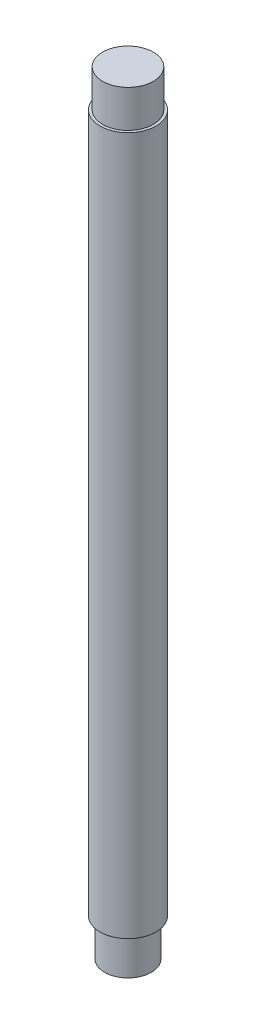
ISO-10303-21;
HEADER;
FILE_DESCRIPTION(('STEP AP214'),'2;1');
FILE_NAME('part.step','',(''),(''),'','','');
FILE_SCHEMA(('AUTOMOTIVE_DESIGN { 1 0 10303 214 1 1 1 1 }'));
ENDSEC;
DATA;
#1=APPLICATION_CONTEXT('core data for automotive mechanical design processes');
#2=APPLICATION_PROTOCOL_DEFINITION('international standard','automotive_design',2000,#1);
#3=PRODUCT_CONTEXT('',#1,'mechanical');
#4=PRODUCT('Part','Part','',(#3));
#5=PRODUCT_RELATED_PRODUCT_CATEGORY('part','',(#4));
#6=PRODUCT_DEFINITION_FORMATION('','',#4);
#7=PRODUCT_DEFINITION_CONTEXT('part definition',#1,'design');
#8=PRODUCT_DEFINITION('design','',#6,#7);
#9=PRODUCT_DEFINITION_SHAPE('','',#8);
#10=(LENGTH_UNIT() NAMED_UNIT(*) SI_UNIT(.MILLI.,.METRE.));
#11=(NAMED_UNIT(*) PLANE_ANGLE_UNIT() SI_UNIT($,.RADIAN.));
#12=(NAMED_UNIT(*) SI_UNIT($,.STERADIAN.) SOLID_ANGLE_UNIT());
#13=UNCERTAINTY_MEASURE_WITH_UNIT(LENGTH_MEASURE(1.E-05),#10,'distance_accuracy_value','');
#14=(GEOMETRIC_REPRESENTATION_CONTEXT(3) GLOBAL_UNCERTAINTY_ASSIGNED_CONTEXT((#13)) GLOBAL_UNIT_ASSIGNED_CONTEXT((#10,
#11,#12)) REPRESENTATION_CONTEXT('',''));
#15=CARTESIAN_POINT('',(0.,0.,0.));
#16=DIRECTION('',(0.,0.,1.));
#17=DIRECTION('',(1.,0.,0.));
#18=AXIS2_PLACEMENT_3D('',#15,#16,#17);
#19=CARTESIAN_POINT('',(0.,237.399999964,0.));
#20=DIRECTION('',(0.,-1.,0.));
#21=DIRECTION('',(0.,0.,-1.));
#22=AXIS2_PLACEMENT_3D('',#19,#20,#21);
#23=CYLINDRICAL_SURFACE('',#22,9.525);
#24=CARTESIAN_POINT('',(0.,237.399999964,0.));
#25=DIRECTION('',(0.,1.,0.));
#26=DIRECTION('',(0.,0.,1.));
#27=AXIS2_PLACEMENT_3D('',#24,#25,#26);
#28=CIRCLE('',#27,9.525);
#29=CARTESIAN_POINT('',(0.,237.399999964,9.525));
#30=VERTEX_POINT('',#29);
#31=EDGE_CURVE('E55',#30,#30,#28,.T.);
#32=ORIENTED_EDGE('',*,*,#31,.F.);
#33=EDGE_LOOP('',(#32));
#34=FACE_BOUND('',#33,.T.);
#35=CARTESIAN_POINT('',(0.,0.,0.));
#36=DIRECTION('',(0.,1.,0.));
#37=DIRECTION('',(0.,0.,1.));
#38=AXIS2_PLACEMENT_3D('',#35,#36,#37);
#39=CIRCLE('',#38,9.525);
#40=CARTESIAN_POINT('',(0.,0.,9.525));
#41=VERTEX_POINT('',#40);
#42=EDGE_CURVE('E44',#41,#41,#39,.T.);
#43=ORIENTED_EDGE('',*,*,#42,.T.);
#44=EDGE_LOOP('',(#43));
#45=FACE_BOUND('',#44,.T.);
#46=ADVANCED_FACE('F41',(#34,#45),#23,.T.);
#47=CARTESIAN_POINT('',(0.,237.399999964,0.));
#48=DIRECTION('',(0.,1.,0.));
#49=DIRECTION('',(0.,0.,1.));
#50=AXIS2_PLACEMENT_3D('',#47,#48,#49);
#51=PLANE('',#50);
#52=CARTESIAN_POINT('',(0.,237.399999964,0.));
#53=DIRECTION('',(0.,1.,0.));
#54=DIRECTION('',(0.,0.,1.));
#55=AXIS2_PLACEMENT_3D('',#52,#53,#54);
#56=CIRCLE('',#55,8.62100577303166);
#57=CARTESIAN_POINT('',(0.,237.399999964,8.62100577303166));
#58=VERTEX_POINT('',#57);
#59=EDGE_CURVE('E49',#58,#58,#56,.T.);
#60=ORIENTED_EDGE('',*,*,#59,.F.);
#61=EDGE_LOOP('',(#60));
#62=FACE_BOUND('',#61,.T.);
#63=ORIENTED_EDGE('',*,*,#31,.T.);
#64=EDGE_LOOP('',(#63));
#65=FACE_BOUND('',#64,.T.);
#66=ADVANCED_FACE('F75',(#62,#65),#51,.T.);
#67=CARTESIAN_POINT('',(0.,0.,0.));
#68=DIRECTION('',(0.,1.,0.));
#69=DIRECTION('',(0.,0.,1.));
#70=AXIS2_PLACEMENT_3D('',#67,#68,#69);
#71=PLANE('',#70);
#72=CARTESIAN_POINT('',(0.,0.,0.));
#73=DIRECTION('',(0.,-1.,0.));
#74=DIRECTION('',(0.,0.,-1.));
#75=AXIS2_PLACEMENT_3D('',#72,#73,#74);
#76=CIRCLE('',#75,7.9375);
#77=CARTESIAN_POINT('',(0.,0.,-7.9375));
#78=VERTEX_POINT('',#77);
#79=EDGE_CURVE('E10',#78,#78,#76,.T.);
#80=ORIENTED_EDGE('',*,*,#79,.F.);
#81=EDGE_LOOP('',(#80));
#82=FACE_BOUND('',#81,.T.);
#83=ORIENTED_EDGE('',*,*,#42,.F.);
#84=EDGE_LOOP('',(#83));
#85=FACE_BOUND('',#84,.T.);
#86=ADVANCED_FACE('F72',(#82,#85),#71,.F.);
#87=CARTESIAN_POINT('',(0.,250.099999964,0.));
#88=DIRECTION('',(0.,-1.,0.));
#89=DIRECTION('',(0.,0.,-1.));
#90=AXIS2_PLACEMENT_3D('',#87,#88,#89);
#91=CYLINDRICAL_SURFACE('',#90,8.62100577303166);
#92=CARTESIAN_POINT('',(0.,250.099999964,0.));
#93=DIRECTION('',(0.,1.,0.));
#94=DIRECTION('',(0.,0.,1.));
#95=AXIS2_PLACEMENT_3D('',#92,#93,#94);
#96=CIRCLE('',#95,8.62100577303166);
#97=CARTESIAN_POINT('',(0.,250.099999964,8.62100577303166));
#98=VERTEX_POINT('',#97);
#99=EDGE_CURVE('E60',#98,#98,#96,.T.);
#100=ORIENTED_EDGE('',*,*,#99,.F.);
#101=EDGE_LOOP('',(#100));
#102=FACE_BOUND('',#101,.T.);
#103=ORIENTED_EDGE('',*,*,#59,.T.);
#104=EDGE_LOOP('',(#103));
#105=FACE_BOUND('',#104,.T.);
#106=ADVANCED_FACE('F74',(#102,#105),#91,.T.);
#107=CARTESIAN_POINT('',(0.,250.099999964,0.));
#108=DIRECTION('',(0.,1.,0.));
#109=DIRECTION('',(0.,0.,1.));
#110=AXIS2_PLACEMENT_3D('',#107,#108,#109);
#111=PLANE('',#110);
#112=ORIENTED_EDGE('',*,*,#99,.T.);
#113=EDGE_LOOP('',(#112));
#114=FACE_BOUND('',#113,.T.);
#115=ADVANCED_FACE('F81',(#114),#111,.T.);
#116=CARTESIAN_POINT('',(0.,-12.7,0.));
#117=DIRECTION('',(0.,1.,0.));
#118=DIRECTION('',(0.,0.,1.));
#119=AXIS2_PLACEMENT_3D('',#116,#117,#118);
#120=CYLINDRICAL_SURFACE('',#119,7.9375);
#121=CARTESIAN_POINT('',(0.,-12.7,0.));
#122=DIRECTION('',(0.,-1.,0.));
#123=DIRECTION('',(0.,0.,-1.));
#124=AXIS2_PLACEMENT_3D('',#121,#122,#123);
#125=CIRCLE('',#124,7.9375);
#126=CARTESIAN_POINT('',(0.,-12.7,-7.9375));
#127=VERTEX_POINT('',#126);
#128=EDGE_CURVE('E59',#127,#127,#125,.T.);
#129=ORIENTED_EDGE('',*,*,#128,.F.);
#130=EDGE_LOOP('',(#129));
#131=FACE_BOUND('',#130,.T.);
#132=ORIENTED_EDGE('',*,*,#79,.T.);
#133=EDGE_LOOP('',(#132));
#134=FACE_BOUND('',#133,.T.);
#135=ADVANCED_FACE('F111',(#131,#134),#120,.T.);
#136=CARTESIAN_POINT('',(0.,-12.7,0.));
#137=DIRECTION('',(0.,-1.,0.));
#138=DIRECTION('',(0.,0.,-1.));
#139=AXIS2_PLACEMENT_3D('',#136,#137,#138);
#140=PLANE('',#139);
#141=ORIENTED_EDGE('',*,*,#128,.T.);
#142=EDGE_LOOP('',(#141));
#143=FACE_BOUND('',#142,.T.);
#144=ADVANCED_FACE('F127',(#143),#140,.T.);
#145=CLOSED_SHELL('',(#46,#66,#86,#106,#115,#135,#144));
#146=MANIFOLD_SOLID_BREP('B2',#145);
#147=ADVANCED_BREP_SHAPE_REPRESENTATION('',(#18,#146),#14);
#148=SHAPE_DEFINITION_REPRESENTATION(#9,#147);
ENDSEC;
END-ISO-10303-21;
